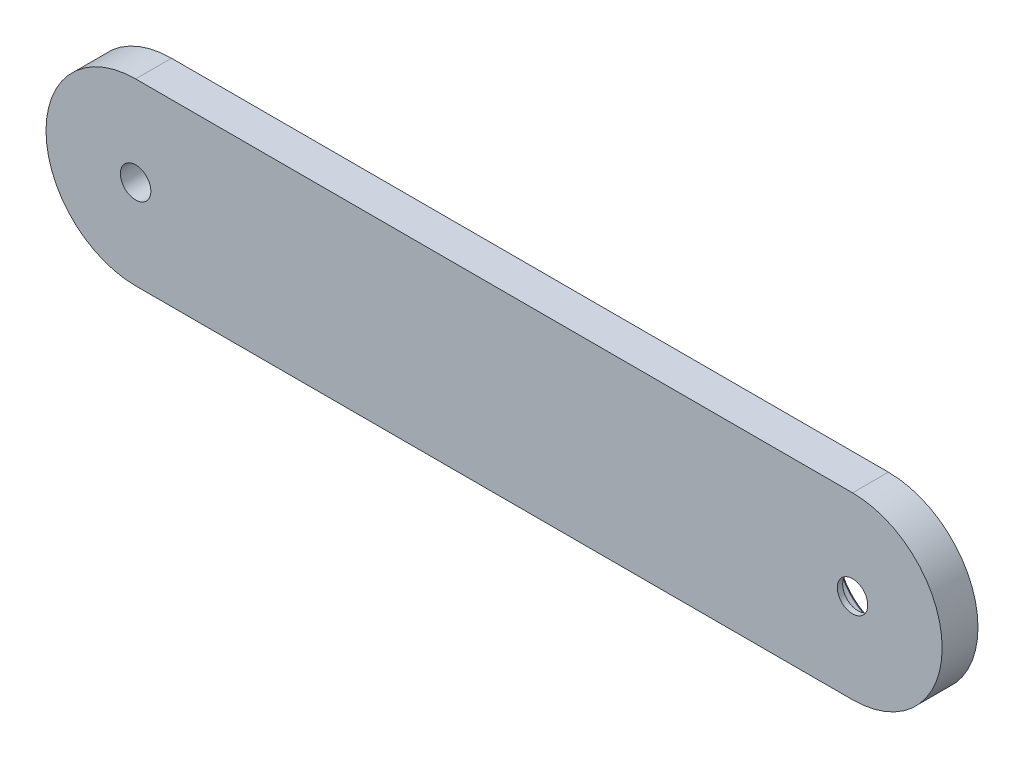
ISO-10303-21;
HEADER;
FILE_DESCRIPTION(('STEP AP214'),'2;1');
FILE_NAME('part.step','',(''),(''),'','','');
FILE_SCHEMA(('AUTOMOTIVE_DESIGN { 1 0 10303 214 1 1 1 1 }'));
ENDSEC;
DATA;
#1=APPLICATION_CONTEXT('core data for automotive mechanical design processes');
#2=APPLICATION_PROTOCOL_DEFINITION('international standard','automotive_design',2000,#1);
#3=PRODUCT_CONTEXT('',#1,'mechanical');
#4=PRODUCT('Part','Part','',(#3));
#5=PRODUCT_RELATED_PRODUCT_CATEGORY('part','',(#4));
#6=PRODUCT_DEFINITION_FORMATION('','',#4);
#7=PRODUCT_DEFINITION_CONTEXT('part definition',#1,'design');
#8=PRODUCT_DEFINITION('design','',#6,#7);
#9=PRODUCT_DEFINITION_SHAPE('','',#8);
#10=(LENGTH_UNIT() NAMED_UNIT(*) SI_UNIT(.MILLI.,.METRE.));
#11=(NAMED_UNIT(*) PLANE_ANGLE_UNIT() SI_UNIT($,.RADIAN.));
#12=(NAMED_UNIT(*) SI_UNIT($,.STERADIAN.) SOLID_ANGLE_UNIT());
#13=UNCERTAINTY_MEASURE_WITH_UNIT(LENGTH_MEASURE(1.E-05),#10,'distance_accuracy_value','');
#14=(GEOMETRIC_REPRESENTATION_CONTEXT(3) GLOBAL_UNCERTAINTY_ASSIGNED_CONTEXT((#13)) GLOBAL_UNIT_ASSIGNED_CONTEXT((#10,
#11,#12)) REPRESENTATION_CONTEXT('',''));
#15=CARTESIAN_POINT('',(0.,0.,0.));
#16=DIRECTION('',(0.,0.,1.));
#17=DIRECTION('',(1.,0.,0.));
#18=AXIS2_PLACEMENT_3D('',#15,#16,#17);
#19=CARTESIAN_POINT('',(-60.,0.,6.));
#20=DIRECTION('',(0.,0.,-1.));
#21=DIRECTION('',(-1.,0.,0.));
#22=AXIS2_PLACEMENT_3D('',#19,#20,#21);
#23=CYLINDRICAL_SURFACE('',#22,15.);
#24=CARTESIAN_POINT('',(-60.,0.,0.));
#25=DIRECTION('',(0.,0.,1.));
#26=DIRECTION('',(-1.,0.,0.));
#27=AXIS2_PLACEMENT_3D('',#24,#25,#26);
#28=CIRCLE('',#27,15.);
#29=CARTESIAN_POINT('',(-60.,15.,0.));
#30=VERTEX_POINT('',#29);
#31=CARTESIAN_POINT('',(-60.,-15.,0.));
#32=VERTEX_POINT('',#31);
#33=EDGE_CURVE('E114',#30,#32,#28,.T.);
#34=ORIENTED_EDGE('',*,*,#33,.T.);
#35=DIRECTION('',(0.,0.,-1.));
#36=VECTOR('',#35,1.);
#37=CARTESIAN_POINT('',(-60.,-15.,6.));
#38=LINE('',#37,#36);
#39=CARTESIAN_POINT('',(-60.,-15.,6.));
#40=VERTEX_POINT('',#39);
#41=EDGE_CURVE('E105',#40,#32,#38,.T.);
#42=ORIENTED_EDGE('',*,*,#41,.F.);
#43=CARTESIAN_POINT('',(-60.,0.,6.));
#44=DIRECTION('',(0.,0.,1.));
#45=DIRECTION('',(-1.,0.,0.));
#46=AXIS2_PLACEMENT_3D('',#43,#44,#45);
#47=CIRCLE('',#46,15.);
#48=CARTESIAN_POINT('',(-60.,15.,6.));
#49=VERTEX_POINT('',#48);
#50=EDGE_CURVE('E99',#49,#40,#47,.T.);
#51=ORIENTED_EDGE('',*,*,#50,.F.);
#52=DIRECTION('',(0.,0.,-1.));
#53=VECTOR('',#52,1.);
#54=CARTESIAN_POINT('',(-60.,15.,6.));
#55=LINE('',#54,#53);
#56=EDGE_CURVE('E110',#49,#30,#55,.T.);
#57=ORIENTED_EDGE('',*,*,#56,.T.);
#58=EDGE_LOOP('',(#34,#42,#51,#57));
#59=FACE_BOUND('',#58,.T.);
#60=ADVANCED_FACE('F45',(#59),#23,.T.);
#61=CARTESIAN_POINT('',(60.,-15.,6.));
#62=DIRECTION('',(0.,1.,0.));
#63=DIRECTION('',(0.,0.,1.));
#64=AXIS2_PLACEMENT_3D('',#61,#62,#63);
#65=PLANE('',#64);
#66=DIRECTION('',(1.,0.,0.));
#67=VECTOR('',#66,1.);
#68=CARTESIAN_POINT('',(60.,-15.,0.));
#69=LINE('',#68,#67);
#70=CARTESIAN_POINT('',(60.,-15.,0.));
#71=VERTEX_POINT('',#70);
#72=EDGE_CURVE('E104',#32,#71,#69,.T.);
#73=ORIENTED_EDGE('',*,*,#72,.T.);
#74=DIRECTION('',(0.,0.,-1.));
#75=VECTOR('',#74,1.);
#76=CARTESIAN_POINT('',(60.,-15.,6.));
#77=LINE('',#76,#75);
#78=CARTESIAN_POINT('',(60.,-15.,6.));
#79=VERTEX_POINT('',#78);
#80=EDGE_CURVE('E102',#79,#71,#77,.T.);
#81=ORIENTED_EDGE('',*,*,#80,.F.);
#82=DIRECTION('',(1.,0.,0.));
#83=VECTOR('',#82,1.);
#84=CARTESIAN_POINT('',(60.,-15.,6.));
#85=LINE('',#84,#83);
#86=EDGE_CURVE('E94',#40,#79,#85,.T.);
#87=ORIENTED_EDGE('',*,*,#86,.F.);
#88=ORIENTED_EDGE('',*,*,#41,.T.);
#89=EDGE_LOOP('',(#73,#81,#87,#88));
#90=FACE_BOUND('',#89,.T.);
#91=ADVANCED_FACE('F103',(#90),#65,.F.);
#92=CARTESIAN_POINT('',(60.,0.,6.));
#93=DIRECTION('',(0.,0.,-1.));
#94=DIRECTION('',(-1.,0.,0.));
#95=AXIS2_PLACEMENT_3D('',#92,#93,#94);
#96=CYLINDRICAL_SURFACE('',#95,15.);
#97=CARTESIAN_POINT('',(60.,0.,0.));
#98=DIRECTION('',(0.,0.,1.));
#99=DIRECTION('',(-1.,0.,0.));
#100=AXIS2_PLACEMENT_3D('',#97,#98,#99);
#101=CIRCLE('',#100,15.);
#102=CARTESIAN_POINT('',(60.,15.,0.));
#103=VERTEX_POINT('',#102);
#104=EDGE_CURVE('E80',#71,#103,#101,.T.);
#105=ORIENTED_EDGE('',*,*,#104,.T.);
#106=DIRECTION('',(0.,0.,-1.));
#107=VECTOR('',#106,1.);
#108=CARTESIAN_POINT('',(60.,15.,6.));
#109=LINE('',#108,#107);
#110=CARTESIAN_POINT('',(60.,15.,6.));
#111=VERTEX_POINT('',#110);
#112=EDGE_CURVE('E106',#111,#103,#109,.T.);
#113=ORIENTED_EDGE('',*,*,#112,.F.);
#114=CARTESIAN_POINT('',(60.,0.,6.));
#115=DIRECTION('',(0.,0.,1.));
#116=DIRECTION('',(-1.,0.,0.));
#117=AXIS2_PLACEMENT_3D('',#114,#115,#116);
#118=CIRCLE('',#117,15.);
#119=EDGE_CURVE('E97',#79,#111,#118,.T.);
#120=ORIENTED_EDGE('',*,*,#119,.F.);
#121=ORIENTED_EDGE('',*,*,#80,.T.);
#122=EDGE_LOOP('',(#105,#113,#120,#121));
#123=FACE_BOUND('',#122,.T.);
#124=ADVANCED_FACE('F108',(#123),#96,.T.);
#125=CARTESIAN_POINT('',(-60.,15.,6.));
#126=DIRECTION('',(0.,-1.,0.));
#127=DIRECTION('',(0.,0.,-1.));
#128=AXIS2_PLACEMENT_3D('',#125,#126,#127);
#129=PLANE('',#128);
#130=DIRECTION('',(-1.,0.,0.));
#131=VECTOR('',#130,1.);
#132=CARTESIAN_POINT('',(-60.,15.,0.));
#133=LINE('',#132,#131);
#134=EDGE_CURVE('E86',#103,#30,#133,.T.);
#135=ORIENTED_EDGE('',*,*,#134,.T.);
#136=ORIENTED_EDGE('',*,*,#56,.F.);
#137=DIRECTION('',(-1.,0.,0.));
#138=VECTOR('',#137,1.);
#139=CARTESIAN_POINT('',(-60.,15.,6.));
#140=LINE('',#139,#138);
#141=EDGE_CURVE('E63',#111,#49,#140,.T.);
#142=ORIENTED_EDGE('',*,*,#141,.F.);
#143=ORIENTED_EDGE('',*,*,#112,.T.);
#144=EDGE_LOOP('',(#135,#136,#142,#143));
#145=FACE_BOUND('',#144,.T.);
#146=ADVANCED_FACE('F149',(#145),#129,.F.);
#147=CARTESIAN_POINT('',(-60.,0.,6.));
#148=DIRECTION('',(0.,0.,-1.));
#149=DIRECTION('',(-1.,0.,0.));
#150=AXIS2_PLACEMENT_3D('',#147,#148,#149);
#151=PLANE('',#150);
#152=CARTESIAN_POINT('',(-60.,0.,6.));
#153=DIRECTION('',(0.,0.,-1.));
#154=DIRECTION('',(-1.,0.,0.));
#155=AXIS2_PLACEMENT_3D('',#152,#153,#154);
#156=CIRCLE('',#155,2.55);
#157=CARTESIAN_POINT('',(-62.55,0.,6.));
#158=VERTEX_POINT('',#157);
#159=EDGE_CURVE('E175',#158,#158,#156,.T.);
#160=ORIENTED_EDGE('',*,*,#159,.T.);
#161=EDGE_LOOP('',(#160));
#162=FACE_BOUND('',#161,.T.);
#163=CARTESIAN_POINT('',(60.,0.,6.));
#164=DIRECTION('',(0.,0.,-1.));
#165=DIRECTION('',(-1.,0.,0.));
#166=AXIS2_PLACEMENT_3D('',#163,#164,#165);
#167=CIRCLE('',#166,2.55);
#168=CARTESIAN_POINT('',(57.45,0.,6.));
#169=VERTEX_POINT('',#168);
#170=EDGE_CURVE('E171',#169,#169,#167,.T.);
#171=ORIENTED_EDGE('',*,*,#170,.T.);
#172=EDGE_LOOP('',(#171));
#173=FACE_BOUND('',#172,.T.);
#174=ORIENTED_EDGE('',*,*,#50,.T.);
#175=ORIENTED_EDGE('',*,*,#86,.T.);
#176=ORIENTED_EDGE('',*,*,#119,.T.);
#177=ORIENTED_EDGE('',*,*,#141,.T.);
#178=EDGE_LOOP('',(#174,#175,#176,#177));
#179=FACE_BOUND('',#178,.T.);
#180=ADVANCED_FACE('F95',(#162,#173,#179),#151,.F.);
#181=CARTESIAN_POINT('',(-60.,0.,0.));
#182=DIRECTION('',(0.,0.,-1.));
#183=DIRECTION('',(-1.,0.,0.));
#184=AXIS2_PLACEMENT_3D('',#181,#182,#183);
#185=PLANE('',#184);
#186=CARTESIAN_POINT('',(60.,0.,0.));
#187=DIRECTION('',(0.,0.,-1.));
#188=DIRECTION('',(-1.,0.,0.));
#189=AXIS2_PLACEMENT_3D('',#186,#187,#188);
#190=CIRCLE('',#189,8.47499999999997);
#191=CARTESIAN_POINT('',(51.525,0.,0.));
#192=VERTEX_POINT('',#191);
#193=EDGE_CURVE('E11',#192,#192,#190,.F.);
#194=ORIENTED_EDGE('',*,*,#193,.T.);
#195=EDGE_LOOP('',(#194));
#196=FACE_BOUND('',#195,.T.);
#197=CARTESIAN_POINT('',(-60.,0.,0.));
#198=DIRECTION('',(0.,0.,-1.));
#199=DIRECTION('',(-1.,0.,0.));
#200=AXIS2_PLACEMENT_3D('',#197,#198,#199);
#201=CIRCLE('',#200,2.55);
#202=CARTESIAN_POINT('',(-62.55,0.,0.));
#203=VERTEX_POINT('',#202);
#204=EDGE_CURVE('E179',#203,#203,#201,.T.);
#205=ORIENTED_EDGE('',*,*,#204,.F.);
#206=EDGE_LOOP('',(#205));
#207=FACE_BOUND('',#206,.T.);
#208=ORIENTED_EDGE('',*,*,#33,.F.);
#209=ORIENTED_EDGE('',*,*,#134,.F.);
#210=ORIENTED_EDGE('',*,*,#104,.F.);
#211=ORIENTED_EDGE('',*,*,#72,.F.);
#212=EDGE_LOOP('',(#208,#209,#210,#211));
#213=FACE_BOUND('',#212,.T.);
#214=ADVANCED_FACE('F152',(#196,#207,#213),#185,.T.);
#215=CARTESIAN_POINT('',(60.,0.,5.1));
#216=DIRECTION('',(0.,0.,-1.));
#217=DIRECTION('',(-1.,0.,0.));
#218=AXIS2_PLACEMENT_3D('',#215,#216,#217);
#219=CYLINDRICAL_SURFACE('',#218,7.975);
#220=CARTESIAN_POINT('',(60.,0.,0.499999999999969));
#221=DIRECTION('',(0.,0.,-1.));
#222=DIRECTION('',(-1.,0.,0.));
#223=AXIS2_PLACEMENT_3D('',#220,#221,#222);
#224=CIRCLE('',#223,7.975);
#225=CARTESIAN_POINT('',(52.025,0.,0.499999999999969));
#226=VERTEX_POINT('',#225);
#227=EDGE_CURVE('E55',#226,#226,#224,.T.);
#228=ORIENTED_EDGE('',*,*,#227,.T.);
#229=EDGE_LOOP('',(#228));
#230=FACE_BOUND('',#229,.T.);
#231=CARTESIAN_POINT('',(60.,0.,5.1));
#232=DIRECTION('',(0.,0.,-1.));
#233=DIRECTION('',(-1.,0.,0.));
#234=AXIS2_PLACEMENT_3D('',#231,#232,#233);
#235=CIRCLE('',#234,7.975);
#236=CARTESIAN_POINT('',(52.025,0.,5.1));
#237=VERTEX_POINT('',#236);
#238=EDGE_CURVE('E117',#237,#237,#235,.T.);
#239=ORIENTED_EDGE('',*,*,#238,.F.);
#240=EDGE_LOOP('',(#239));
#241=FACE_BOUND('',#240,.T.);
#242=ADVANCED_FACE('F126',(#230,#241),#219,.F.);
#243=CARTESIAN_POINT('',(60.,0.,5.1));
#244=DIRECTION('',(0.,0.,-1.));
#245=DIRECTION('',(-1.,0.,0.));
#246=AXIS2_PLACEMENT_3D('',#243,#244,#245);
#247=PLANE('',#246);
#248=CARTESIAN_POINT('',(60.,0.,5.1));
#249=DIRECTION('',(0.,0.,-1.));
#250=DIRECTION('',(-1.,0.,0.));
#251=AXIS2_PLACEMENT_3D('',#248,#249,#250);
#252=CIRCLE('',#251,2.55);
#253=CARTESIAN_POINT('',(57.45,0.,5.1));
#254=VERTEX_POINT('',#253);
#255=EDGE_CURVE('E174',#254,#254,#252,.T.);
#256=ORIENTED_EDGE('',*,*,#255,.F.);
#257=EDGE_LOOP('',(#256));
#258=FACE_BOUND('',#257,.T.);
#259=ORIENTED_EDGE('',*,*,#238,.T.);
#260=EDGE_LOOP('',(#259));
#261=FACE_BOUND('',#260,.T.);
#262=ADVANCED_FACE('F160',(#258,#261),#247,.T.);
#263=CARTESIAN_POINT('',(60.,0.,6.));
#264=DIRECTION('',(0.,0.,-1.));
#265=DIRECTION('',(-1.,0.,0.));
#266=AXIS2_PLACEMENT_3D('',#263,#264,#265);
#267=CYLINDRICAL_SURFACE('',#266,2.55);
#268=ORIENTED_EDGE('',*,*,#170,.F.);
#269=EDGE_LOOP('',(#268));
#270=FACE_BOUND('',#269,.T.);
#271=ORIENTED_EDGE('',*,*,#255,.T.);
#272=EDGE_LOOP('',(#271));
#273=FACE_BOUND('',#272,.T.);
#274=ADVANCED_FACE('F136',(#270,#273),#267,.F.);
#275=CARTESIAN_POINT('',(-60.,0.,6.));
#276=DIRECTION('',(0.,0.,-1.));
#277=DIRECTION('',(-1.,0.,0.));
#278=AXIS2_PLACEMENT_3D('',#275,#276,#277);
#279=CYLINDRICAL_SURFACE('',#278,2.55);
#280=ORIENTED_EDGE('',*,*,#159,.F.);
#281=EDGE_LOOP('',(#280));
#282=FACE_BOUND('',#281,.T.);
#283=ORIENTED_EDGE('',*,*,#204,.T.);
#284=EDGE_LOOP('',(#283));
#285=FACE_BOUND('',#284,.T.);
#286=ADVANCED_FACE('F130',(#282,#285),#279,.F.);
#287=CARTESIAN_POINT('',(60.,0.,0.499999999999969));
#288=DIRECTION('',(0.,0.,-1.));
#289=DIRECTION('',(-1.,0.,0.));
#290=AXIS2_PLACEMENT_3D('',#287,#288,#289);
#291=CONICAL_SURFACE('',#290,7.975,0.785398163397448);
#292=ORIENTED_EDGE('',*,*,#193,.F.);
#293=EDGE_LOOP('',(#292));
#294=FACE_BOUND('',#293,.T.);
#295=ORIENTED_EDGE('',*,*,#227,.F.);
#296=EDGE_LOOP('',(#295));
#297=FACE_BOUND('',#296,.T.);
#298=ADVANCED_FACE('F48',(#294,#297),#291,.F.);
#299=CLOSED_SHELL('',(#60,#91,#124,#146,#180,#214,#242,#262,#274,#286,#298));
#300=MANIFOLD_SOLID_BREP('B2',#299);
#301=ADVANCED_BREP_SHAPE_REPRESENTATION('',(#18,#300),#14);
#302=SHAPE_DEFINITION_REPRESENTATION(#9,#301);
ENDSEC;
END-ISO-10303-21;
